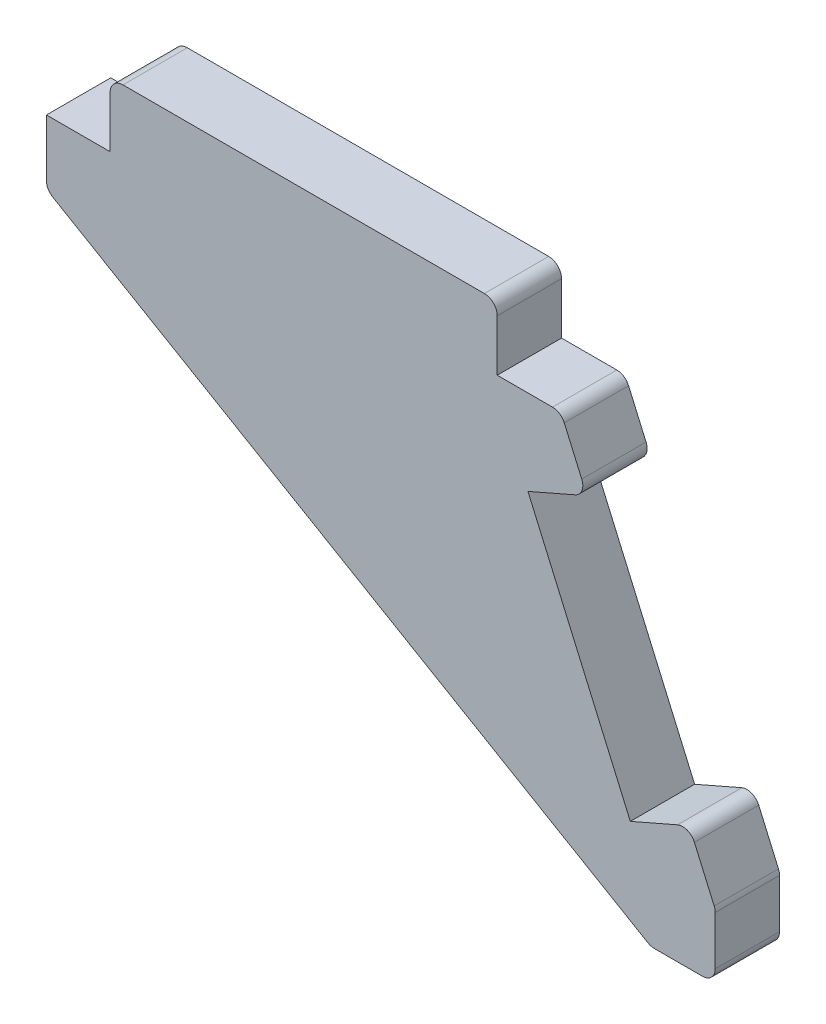
ISO-10303-21;
HEADER;
FILE_DESCRIPTION(('STEP AP214'),'2;1');
FILE_NAME('part.step','',(''),(''),'','','');
FILE_SCHEMA(('AUTOMOTIVE_DESIGN { 1 0 10303 214 1 1 1 1 }'));
ENDSEC;
DATA;
#1=APPLICATION_CONTEXT('core data for automotive mechanical design processes');
#2=APPLICATION_PROTOCOL_DEFINITION('international standard','automotive_design',2000,#1);
#3=PRODUCT_CONTEXT('',#1,'mechanical');
#4=PRODUCT('Part','Part','',(#3));
#5=PRODUCT_RELATED_PRODUCT_CATEGORY('part','',(#4));
#6=PRODUCT_DEFINITION_FORMATION('','',#4);
#7=PRODUCT_DEFINITION_CONTEXT('part definition',#1,'design');
#8=PRODUCT_DEFINITION('design','',#6,#7);
#9=PRODUCT_DEFINITION_SHAPE('','',#8);
#10=(LENGTH_UNIT() NAMED_UNIT(*) SI_UNIT(.MILLI.,.METRE.));
#11=(NAMED_UNIT(*) PLANE_ANGLE_UNIT() SI_UNIT($,.RADIAN.));
#12=(NAMED_UNIT(*) SI_UNIT($,.STERADIAN.) SOLID_ANGLE_UNIT());
#13=UNCERTAINTY_MEASURE_WITH_UNIT(LENGTH_MEASURE(1.E-05),#10,'distance_accuracy_value','');
#14=(GEOMETRIC_REPRESENTATION_CONTEXT(3) GLOBAL_UNCERTAINTY_ASSIGNED_CONTEXT((#13)) GLOBAL_UNIT_ASSIGNED_CONTEXT((#10,
#11,#12)) REPRESENTATION_CONTEXT('',''));
#15=CARTESIAN_POINT('',(0.,0.,0.));
#16=DIRECTION('',(0.,0.,1.));
#17=DIRECTION('',(1.,0.,0.));
#18=AXIS2_PLACEMENT_3D('',#15,#16,#17);
#19=CARTESIAN_POINT('',(4.95,5.00000000000043,5.));
#20=DIRECTION('',(1.,0.,0.));
#21=DIRECTION('',(0.,1.,0.));
#22=AXIS2_PLACEMENT_3D('',#19,#20,#21);
#23=PLANE('',#22);
#24=DIRECTION('',(0.,-1.,0.));
#25=VECTOR('',#24,1.);
#26=CARTESIAN_POINT('',(4.95,5.00000000000043,5.));
#27=LINE('',#26,#25);
#28=CARTESIAN_POINT('',(4.95,4.00000000000043,5.));
#29=VERTEX_POINT('',#28);
#30=CARTESIAN_POINT('',(4.95,0.,5.));
#31=VERTEX_POINT('',#30);
#32=EDGE_CURVE('E192',#29,#31,#27,.T.);
#33=ORIENTED_EDGE('',*,*,#32,.F.);
#34=DIRECTION('',(0.,0.,-1.));
#35=VECTOR('',#34,1.);
#36=CARTESIAN_POINT('',(4.95,4.00000000000043,5.));
#37=LINE('',#36,#35);
#38=CARTESIAN_POINT('',(4.95,4.00000000000043,0.));
#39=VERTEX_POINT('',#38);
#40=EDGE_CURVE('E11',#29,#39,#37,.T.);
#41=ORIENTED_EDGE('',*,*,#40,.T.);
#42=DIRECTION('',(0.,-1.,0.));
#43=VECTOR('',#42,1.);
#44=CARTESIAN_POINT('',(4.95,5.00000000000043,0.));
#45=LINE('',#44,#43);
#46=CARTESIAN_POINT('',(4.95,0.,0.));
#47=VERTEX_POINT('',#46);
#48=EDGE_CURVE('E216',#39,#47,#45,.T.);
#49=ORIENTED_EDGE('',*,*,#48,.T.);
#50=DIRECTION('',(0.,0.,-1.));
#51=VECTOR('',#50,1.);
#52=CARTESIAN_POINT('',(4.95,0.,5.));
#53=LINE('',#52,#51);
#54=EDGE_CURVE('E209',#31,#47,#53,.T.);
#55=ORIENTED_EDGE('',*,*,#54,.F.);
#56=EDGE_LOOP('',(#33,#41,#49,#55));
#57=FACE_BOUND('',#56,.T.);
#58=ADVANCED_FACE('F37',(#57),#23,.F.);
#59=CARTESIAN_POINT('',(4.95,0.,5.));
#60=DIRECTION('',(0.,-1.,0.));
#61=DIRECTION('',(1.,0.,0.));
#62=AXIS2_PLACEMENT_3D('',#59,#60,#61);
#63=PLANE('',#62);
#64=DIRECTION('',(-1.,0.,0.));
#65=VECTOR('',#64,1.);
#66=CARTESIAN_POINT('',(4.95,0.,0.));
#67=LINE('',#66,#65);
#68=CARTESIAN_POINT('',(0.,0.,0.));
#69=VERTEX_POINT('',#68);
#70=EDGE_CURVE('E370',#47,#69,#67,.T.);
#71=ORIENTED_EDGE('',*,*,#70,.T.);
#72=DIRECTION('',(0.,0.,-1.));
#73=VECTOR('',#72,1.);
#74=CARTESIAN_POINT('',(0.,0.,5.));
#75=LINE('',#74,#73);
#76=CARTESIAN_POINT('',(0.,0.,5.));
#77=VERTEX_POINT('',#76);
#78=EDGE_CURVE('E211',#77,#69,#75,.T.);
#79=ORIENTED_EDGE('',*,*,#78,.F.);
#80=DIRECTION('',(-1.,0.,0.));
#81=VECTOR('',#80,1.);
#82=CARTESIAN_POINT('',(4.95,0.,5.));
#83=LINE('',#82,#81);
#84=EDGE_CURVE('E197',#31,#77,#83,.T.);
#85=ORIENTED_EDGE('',*,*,#84,.F.);
#86=ORIENTED_EDGE('',*,*,#54,.T.);
#87=EDGE_LOOP('',(#71,#79,#85,#86));
#88=FACE_BOUND('',#87,.T.);
#89=ADVANCED_FACE('F208',(#88),#63,.F.);
#90=CARTESIAN_POINT('',(0.,0.,5.));
#91=DIRECTION('',(1.,0.,0.));
#92=DIRECTION('',(0.,1.,0.));
#93=AXIS2_PLACEMENT_3D('',#90,#91,#92);
#94=PLANE('',#93);
#95=DIRECTION('',(0.,-1.,0.));
#96=VECTOR('',#95,1.);
#97=CARTESIAN_POINT('',(0.,0.,0.));
#98=LINE('',#97,#96);
#99=CARTESIAN_POINT('',(0.,-4.42646043849972,0.));
#100=VERTEX_POINT('',#99);
#101=EDGE_CURVE('E372',#69,#100,#98,.T.);
#102=ORIENTED_EDGE('',*,*,#101,.T.);
#103=DIRECTION('',(0.,0.,-1.));
#104=VECTOR('',#103,1.);
#105=CARTESIAN_POINT('',(0.,-4.42646043849972,5.));
#106=LINE('',#105,#104);
#107=CARTESIAN_POINT('',(0.,-4.42646043849972,5.));
#108=VERTEX_POINT('',#107);
#109=EDGE_CURVE('E270',#100,#108,#106,.F.);
#110=ORIENTED_EDGE('',*,*,#109,.T.);
#111=DIRECTION('',(0.,-1.,0.));
#112=VECTOR('',#111,1.);
#113=CARTESIAN_POINT('',(0.,0.,5.));
#114=LINE('',#113,#112);
#115=EDGE_CURVE('E213',#77,#108,#114,.T.);
#116=ORIENTED_EDGE('',*,*,#115,.F.);
#117=ORIENTED_EDGE('',*,*,#78,.T.);
#118=EDGE_LOOP('',(#102,#110,#116,#117));
#119=FACE_BOUND('',#118,.T.);
#120=ADVANCED_FACE('F424',(#119),#94,.F.);
#121=CARTESIAN_POINT('',(0.,-5.,5.));
#122=DIRECTION('',(0.50495020040632,0.863148478020796,0.));
#123=DIRECTION('',(-0.863148478020796,0.50495020040632,0.));
#124=AXIS2_PLACEMENT_3D('',#121,#122,#123);
#125=PLANE('',#124);
#126=DIRECTION('',(0.863148478020796,-0.50495020040632,0.));
#127=VECTOR('',#126,1.);
#128=CARTESIAN_POINT('',(0.,-5.,5.));
#129=LINE('',#128,#127);
#130=CARTESIAN_POINT('',(0.49504979959368,-5.28960891652052,5.));
#131=VERTEX_POINT('',#130);
#132=CARTESIAN_POINT('',(46.7660696385189,-32.3586026477557,5.));
#133=VERTEX_POINT('',#132);
#134=EDGE_CURVE('E460',#131,#133,#129,.T.);
#135=ORIENTED_EDGE('',*,*,#134,.F.);
#136=DIRECTION('',(0.,0.,-1.));
#137=VECTOR('',#136,1.);
#138=CARTESIAN_POINT('',(0.49504979959368,-5.28960891652052,5.));
#139=LINE('',#138,#137);
#140=CARTESIAN_POINT('',(0.49504979959368,-5.28960891652052,0.));
#141=VERTEX_POINT('',#140);
#142=EDGE_CURVE('E267',#131,#141,#139,.T.);
#143=ORIENTED_EDGE('',*,*,#142,.T.);
#144=DIRECTION('',(0.863148478020796,-0.50495020040632,0.));
#145=VECTOR('',#144,1.);
#146=CARTESIAN_POINT('',(0.,-5.,0.));
#147=LINE('',#146,#145);
#148=CARTESIAN_POINT('',(46.7660696385189,-32.3586026477557,0.));
#149=VERTEX_POINT('',#148);
#150=EDGE_CURVE('E375',#141,#149,#147,.T.);
#151=ORIENTED_EDGE('',*,*,#150,.T.);
#152=DIRECTION('',(0.,0.,-1.));
#153=VECTOR('',#152,1.);
#154=CARTESIAN_POINT('',(46.7660696385189,-32.3586026477557,5.));
#155=LINE('',#154,#153);
#156=EDGE_CURVE('E265',#149,#133,#155,.F.);
#157=ORIENTED_EDGE('',*,*,#156,.T.);
#158=EDGE_LOOP('',(#135,#143,#151,#157));
#159=FACE_BOUND('',#158,.T.);
#160=ADVANCED_FACE('F487',(#159),#125,.F.);
#161=CARTESIAN_POINT('',(47.0000000000003,-32.4954541697349,5.));
#162=DIRECTION('',(0.,1.,0.));
#163=DIRECTION('',(0.,0.,1.));
#164=AXIS2_PLACEMENT_3D('',#161,#162,#163);
#165=PLANE('',#164);
#166=DIRECTION('',(1.,0.,0.));
#167=VECTOR('',#166,1.);
#168=CARTESIAN_POINT('',(47.0000000000003,-32.4954541697349,0.));
#169=LINE('',#168,#167);
#170=CARTESIAN_POINT('',(47.2710198389252,-32.4954541697349,0.));
#171=VERTEX_POINT('',#170);
#172=CARTESIAN_POINT('',(51.0000000000003,-32.4954541697349,0.));
#173=VERTEX_POINT('',#172);
#174=EDGE_CURVE('E378',#171,#173,#169,.T.);
#175=ORIENTED_EDGE('',*,*,#174,.T.);
#176=DIRECTION('',(0.,0.,-1.));
#177=VECTOR('',#176,1.);
#178=CARTESIAN_POINT('',(51.0000000000003,-32.4954541697349,5.));
#179=LINE('',#178,#177);
#180=CARTESIAN_POINT('',(51.0000000000003,-32.4954541697349,5.));
#181=VERTEX_POINT('',#180);
#182=EDGE_CURVE('E285',#173,#181,#179,.F.);
#183=ORIENTED_EDGE('',*,*,#182,.T.);
#184=DIRECTION('',(1.,0.,0.));
#185=VECTOR('',#184,1.);
#186=CARTESIAN_POINT('',(47.0000000000003,-32.4954541697349,5.));
#187=LINE('',#186,#185);
#188=CARTESIAN_POINT('',(47.2710198389252,-32.4954541697349,5.));
#189=VERTEX_POINT('',#188);
#190=EDGE_CURVE('E463',#189,#181,#187,.T.);
#191=ORIENTED_EDGE('',*,*,#190,.F.);
#192=DIRECTION('',(0.,0.,-1.));
#193=VECTOR('',#192,1.);
#194=CARTESIAN_POINT('',(47.2710198389252,-32.4954541697349,5.));
#195=LINE('',#194,#193);
#196=EDGE_CURVE('E282',#189,#171,#195,.T.);
#197=ORIENTED_EDGE('',*,*,#196,.T.);
#198=EDGE_LOOP('',(#175,#183,#191,#197));
#199=FACE_BOUND('',#198,.T.);
#200=ADVANCED_FACE('F479',(#199),#165,.F.);
#201=CARTESIAN_POINT('',(52.0000000000003,-27.4954541697349,5.));
#202=DIRECTION('',(-1.,0.,0.));
#203=DIRECTION('',(0.,0.,1.));
#204=AXIS2_PLACEMENT_3D('',#201,#202,#203);
#205=PLANE('',#204);
#206=DIRECTION('',(0.,1.,0.));
#207=VECTOR('',#206,1.);
#208=CARTESIAN_POINT('',(52.0000000000003,-27.4954541697349,0.));
#209=LINE('',#208,#207);
#210=CARTESIAN_POINT('',(52.0000000000003,-31.4954541697349,0.));
#211=VERTEX_POINT('',#210);
#212=CARTESIAN_POINT('',(52.0000000000003,-27.704166322257,0.));
#213=VERTEX_POINT('',#212);
#214=EDGE_CURVE('E381',#211,#213,#209,.T.);
#215=ORIENTED_EDGE('',*,*,#214,.T.);
#216=DIRECTION('',(0.,0.,-1.));
#217=VECTOR('',#216,1.);
#218=CARTESIAN_POINT('',(52.0000000000003,-27.704166322257,5.));
#219=LINE('',#218,#217);
#220=CARTESIAN_POINT('',(52.0000000000003,-27.704166322257,5.));
#221=VERTEX_POINT('',#220);
#222=EDGE_CURVE('E280',#213,#221,#219,.F.);
#223=ORIENTED_EDGE('',*,*,#222,.T.);
#224=DIRECTION('',(0.,1.,0.));
#225=VECTOR('',#224,1.);
#226=CARTESIAN_POINT('',(52.0000000000003,-27.4954541697349,5.));
#227=LINE('',#226,#225);
#228=CARTESIAN_POINT('',(52.0000000000003,-31.4954541697349,5.));
#229=VERTEX_POINT('',#228);
#230=EDGE_CURVE('E400',#229,#221,#227,.T.);
#231=ORIENTED_EDGE('',*,*,#230,.F.);
#232=DIRECTION('',(0.,0.,-1.));
#233=VECTOR('',#232,1.);
#234=CARTESIAN_POINT('',(52.0000000000003,-31.4954541697349,5.));
#235=LINE('',#234,#233);
#236=EDGE_CURVE('E277',#229,#211,#235,.T.);
#237=ORIENTED_EDGE('',*,*,#236,.T.);
#238=EDGE_LOOP('',(#215,#223,#231,#237));
#239=FACE_BOUND('',#238,.T.);
#240=ADVANCED_FACE('F475',(#239),#205,.F.);
#241=CARTESIAN_POINT('',(49.9800000000003,-22.8670527178295,5.));
#242=DIRECTION('',(-0.916515138991163,-0.400000000000013,0.));
#243=DIRECTION('',(0.400000000000013,-0.916515138991163,0.));
#244=AXIS2_PLACEMENT_3D('',#241,#242,#243);
#245=PLANE('',#244);
#246=DIRECTION('',(-0.400000000000013,0.916515138991163,0.));
#247=VECTOR('',#246,1.);
#248=CARTESIAN_POINT('',(49.9800000000003,-22.8670527178295,5.));
#249=LINE('',#248,#247);
#250=CARTESIAN_POINT('',(51.9165151389915,-27.304166322257,5.));
#251=VERTEX_POINT('',#250);
#252=CARTESIAN_POINT('',(50.3800000000003,-23.7835678568207,5.));
#253=VERTEX_POINT('',#252);
#254=EDGE_CURVE('E396',#251,#253,#249,.T.);
#255=ORIENTED_EDGE('',*,*,#254,.F.);
#256=DIRECTION('',(0.,0.,-1.));
#257=VECTOR('',#256,1.);
#258=CARTESIAN_POINT('',(51.9165151389915,-27.304166322257,5.));
#259=LINE('',#258,#257);
#260=CARTESIAN_POINT('',(51.9165151389915,-27.304166322257,0.));
#261=VERTEX_POINT('',#260);
#262=EDGE_CURVE('E274',#251,#261,#259,.T.);
#263=ORIENTED_EDGE('',*,*,#262,.T.);
#264=DIRECTION('',(-0.400000000000013,0.916515138991163,0.));
#265=VECTOR('',#264,1.);
#266=CARTESIAN_POINT('',(49.9800000000003,-22.8670527178295,0.));
#267=LINE('',#266,#265);
#268=CARTESIAN_POINT('',(50.3800000000003,-23.7835678568207,0.));
#269=VERTEX_POINT('',#268);
#270=EDGE_CURVE('E345',#261,#269,#267,.T.);
#271=ORIENTED_EDGE('',*,*,#270,.T.);
#272=DIRECTION('',(0.,0.,-1.));
#273=VECTOR('',#272,1.);
#274=CARTESIAN_POINT('',(50.3800000000003,-23.7835678568207,5.));
#275=LINE('',#274,#273);
#276=EDGE_CURVE('E272',#269,#253,#275,.F.);
#277=ORIENTED_EDGE('',*,*,#276,.T.);
#278=EDGE_LOOP('',(#255,#263,#271,#277));
#279=FACE_BOUND('',#278,.T.);
#280=ADVANCED_FACE('F388',(#279),#245,.F.);
#281=CARTESIAN_POINT('',(45.3974243050445,-24.8670527178296,5.));
#282=DIRECTION('',(0.400000000000013,-0.916515138991162,0.));
#283=DIRECTION('',(0.916515138991162,0.400000000000013,0.));
#284=AXIS2_PLACEMENT_3D('',#281,#282,#283);
#285=PLANE('',#284);
#286=DIRECTION('',(-0.916515138991162,-0.400000000000013,0.));
#287=VECTOR('',#286,1.);
#288=CARTESIAN_POINT('',(45.3974243050445,-24.8670527178296,5.));
#289=LINE('',#288,#287);
#290=CARTESIAN_POINT('',(49.0634848610091,-23.2670527178295,5.));
#291=VERTEX_POINT('',#290);
#292=CARTESIAN_POINT('',(45.3974243050445,-24.8670527178296,5.));
#293=VERTEX_POINT('',#292);
#294=EDGE_CURVE('E395',#291,#293,#289,.T.);
#295=ORIENTED_EDGE('',*,*,#294,.F.);
#296=DIRECTION('',(0.,0.,-1.));
#297=VECTOR('',#296,1.);
#298=CARTESIAN_POINT('',(49.0634848610091,-23.2670527178295,5.));
#299=LINE('',#298,#297);
#300=CARTESIAN_POINT('',(49.0634848610091,-23.2670527178295,0.));
#301=VERTEX_POINT('',#300);
#302=EDGE_CURVE('E287',#291,#301,#299,.T.);
#303=ORIENTED_EDGE('',*,*,#302,.T.);
#304=DIRECTION('',(-0.916515138991162,-0.400000000000013,0.));
#305=VECTOR('',#304,1.);
#306=CARTESIAN_POINT('',(45.3974243050445,-24.8670527178296,0.));
#307=LINE('',#306,#305);
#308=CARTESIAN_POINT('',(45.3974243050445,-24.8670527178296,0.));
#309=VERTEX_POINT('',#308);
#310=EDGE_CURVE('E339',#301,#309,#307,.T.);
#311=ORIENTED_EDGE('',*,*,#310,.T.);
#312=DIRECTION('',(0.,0.,-1.));
#313=VECTOR('',#312,1.);
#314=CARTESIAN_POINT('',(45.3974243050445,-24.8670527178296,5.));
#315=LINE('',#314,#313);
#316=EDGE_CURVE('E223',#293,#309,#315,.T.);
#317=ORIENTED_EDGE('',*,*,#316,.F.);
#318=EDGE_LOOP('',(#295,#303,#311,#317));
#319=FACE_BOUND('',#318,.T.);
#320=ADVANCED_FACE('F397',(#319),#285,.F.);
#321=CARTESIAN_POINT('',(37.4374243050442,-6.62840145190544,5.));
#322=DIRECTION('',(-0.916515138991163,-0.400000000000012,0.));
#323=DIRECTION('',(0.400000000000012,-0.916515138991163,0.));
#324=AXIS2_PLACEMENT_3D('',#321,#322,#323);
#325=PLANE('',#324);
#326=DIRECTION('',(-0.400000000000012,0.916515138991163,0.));
#327=VECTOR('',#326,1.);
#328=CARTESIAN_POINT('',(37.4374243050442,-6.62840145190544,0.));
#329=LINE('',#328,#327);
#330=CARTESIAN_POINT('',(37.4374243050442,-6.62840145190544,0.));
#331=VERTEX_POINT('',#330);
#332=EDGE_CURVE('E333',#309,#331,#329,.T.);
#333=ORIENTED_EDGE('',*,*,#332,.T.);
#334=DIRECTION('',(0.,0.,-1.));
#335=VECTOR('',#334,1.);
#336=CARTESIAN_POINT('',(37.4374243050442,-6.62840145190544,5.));
#337=LINE('',#336,#335);
#338=CARTESIAN_POINT('',(37.4374243050442,-6.62840145190544,5.));
#339=VERTEX_POINT('',#338);
#340=EDGE_CURVE('E324',#339,#331,#337,.T.);
#341=ORIENTED_EDGE('',*,*,#340,.F.);
#342=DIRECTION('',(-0.400000000000012,0.916515138991163,0.));
#343=VECTOR('',#342,1.);
#344=CARTESIAN_POINT('',(37.4374243050442,-6.62840145190544,5.));
#345=LINE('',#344,#343);
#346=EDGE_CURVE('E334',#293,#339,#345,.T.);
#347=ORIENTED_EDGE('',*,*,#346,.F.);
#348=ORIENTED_EDGE('',*,*,#316,.T.);
#349=EDGE_LOOP('',(#333,#341,#347,#348));
#350=FACE_BOUND('',#349,.T.);
#351=ADVANCED_FACE('F331',(#350),#325,.F.);
#352=CARTESIAN_POINT('',(42.0200000000001,-4.62840145190537,5.));
#353=DIRECTION('',(-0.400000000000013,0.916515138991163,0.));
#354=DIRECTION('',(-0.916515138991163,-0.400000000000013,0.));
#355=AXIS2_PLACEMENT_3D('',#352,#353,#354);
#356=PLANE('',#355);
#357=DIRECTION('',(0.916515138991162,0.400000000000013,0.));
#358=VECTOR('',#357,1.);
#359=CARTESIAN_POINT('',(42.0200000000001,-4.62840145190537,0.));
#360=LINE('',#359,#358);
#361=CARTESIAN_POINT('',(41.1034848610089,-5.02840145190539,0.));
#362=VERTEX_POINT('',#361);
#363=EDGE_CURVE('E341',#331,#362,#360,.T.);
#364=ORIENTED_EDGE('',*,*,#363,.T.);
#365=DIRECTION('',(0.,0.,-1.));
#366=VECTOR('',#365,1.);
#367=CARTESIAN_POINT('',(41.1034848610089,-5.02840145190539,5.));
#368=LINE('',#367,#366);
#369=CARTESIAN_POINT('',(41.1034848610089,-5.02840145190539,5.));
#370=VERTEX_POINT('',#369);
#371=EDGE_CURVE('E290',#362,#370,#368,.F.);
#372=ORIENTED_EDGE('',*,*,#371,.T.);
#373=DIRECTION('',(0.916515138991162,0.400000000000013,0.));
#374=VECTOR('',#373,1.);
#375=CARTESIAN_POINT('',(42.0200000000001,-4.62840145190537,5.));
#376=LINE('',#375,#374);
#377=EDGE_CURVE('E364',#339,#370,#376,.T.);
#378=ORIENTED_EDGE('',*,*,#377,.F.);
#379=ORIENTED_EDGE('',*,*,#340,.T.);
#380=EDGE_LOOP('',(#364,#372,#378,#379));
#381=FACE_BOUND('',#380,.T.);
#382=ADVANCED_FACE('F410',(#381),#356,.F.);
#383=CARTESIAN_POINT('',(42.0200000000001,-4.62840145190537,5.));
#384=DIRECTION('',(-0.916515138991163,-0.400000000000012,0.));
#385=DIRECTION('',(0.400000000000012,-0.916515138991163,0.));
#386=AXIS2_PLACEMENT_3D('',#383,#384,#385);
#387=PLANE('',#386);
#388=DIRECTION('',(-0.400000000000012,0.916515138991163,0.));
#389=VECTOR('',#388,1.);
#390=CARTESIAN_POINT('',(42.0200000000001,-4.62840145190537,0.));
#391=LINE('',#390,#389);
#392=CARTESIAN_POINT('',(41.62,-3.71188631291421,0.));
#393=VERTEX_POINT('',#392);
#394=CARTESIAN_POINT('',(40.2618614682832,-0.599999999999985,0.));
#395=VERTEX_POINT('',#394);
#396=EDGE_CURVE('E343',#393,#395,#391,.T.);
#397=ORIENTED_EDGE('',*,*,#396,.T.);
#398=DIRECTION('',(0.,0.,-1.));
#399=VECTOR('',#398,1.);
#400=CARTESIAN_POINT('',(40.2618614682832,-0.599999999999985,5.));
#401=LINE('',#400,#399);
#402=CARTESIAN_POINT('',(40.2618614682832,-0.599999999999985,5.));
#403=VERTEX_POINT('',#402);
#404=EDGE_CURVE('E247',#395,#403,#401,.F.);
#405=ORIENTED_EDGE('',*,*,#404,.T.);
#406=DIRECTION('',(-0.400000000000012,0.916515138991163,0.));
#407=VECTOR('',#406,1.);
#408=CARTESIAN_POINT('',(42.0200000000001,-4.62840145190537,5.));
#409=LINE('',#408,#407);
#410=CARTESIAN_POINT('',(41.62,-3.71188631291421,5.));
#411=VERTEX_POINT('',#410);
#412=EDGE_CURVE('E362',#411,#403,#409,.T.);
#413=ORIENTED_EDGE('',*,*,#412,.F.);
#414=DIRECTION('',(0.,0.,-1.));
#415=VECTOR('',#414,1.);
#416=CARTESIAN_POINT('',(41.62,-3.71188631291421,5.));
#417=LINE('',#416,#415);
#418=EDGE_CURVE('E244',#411,#393,#417,.T.);
#419=ORIENTED_EDGE('',*,*,#418,.T.);
#420=EDGE_LOOP('',(#397,#405,#413,#419));
#421=FACE_BOUND('',#420,.T.);
#422=ADVANCED_FACE('F357',(#421),#387,.F.);
#423=CARTESIAN_POINT('',(40.,0.,5.));
#424=DIRECTION('',(0.,-1.,0.));
#425=DIRECTION('',(1.,0.,0.));
#426=AXIS2_PLACEMENT_3D('',#423,#424,#425);
#427=PLANE('',#426);
#428=DIRECTION('',(-1.,0.,0.));
#429=VECTOR('',#428,1.);
#430=CARTESIAN_POINT('',(40.,0.,5.));
#431=LINE('',#430,#429);
#432=CARTESIAN_POINT('',(39.345346329292,0.,5.));
#433=VERTEX_POINT('',#432);
#434=CARTESIAN_POINT('',(35.05,0.,5.));
#435=VERTEX_POINT('',#434);
#436=EDGE_CURVE('E306',#433,#435,#431,.T.);
#437=ORIENTED_EDGE('',*,*,#436,.F.);
#438=DIRECTION('',(0.,0.,-1.));
#439=VECTOR('',#438,1.);
#440=CARTESIAN_POINT('',(39.345346329292,0.,5.));
#441=LINE('',#440,#439);
#442=CARTESIAN_POINT('',(39.345346329292,0.,0.));
#443=VERTEX_POINT('',#442);
#444=EDGE_CURVE('E218',#433,#443,#441,.T.);
#445=ORIENTED_EDGE('',*,*,#444,.T.);
#446=DIRECTION('',(-1.,0.,0.));
#447=VECTOR('',#446,1.);
#448=CARTESIAN_POINT('',(40.,0.,0.));
#449=LINE('',#448,#447);
#450=CARTESIAN_POINT('',(35.05,0.,0.));
#451=VERTEX_POINT('',#450);
#452=EDGE_CURVE('E318',#443,#451,#449,.T.);
#453=ORIENTED_EDGE('',*,*,#452,.T.);
#454=DIRECTION('',(0.,0.,-1.));
#455=VECTOR('',#454,1.);
#456=CARTESIAN_POINT('',(35.05,0.,5.));
#457=LINE('',#456,#455);
#458=EDGE_CURVE('E322',#435,#451,#457,.T.);
#459=ORIENTED_EDGE('',*,*,#458,.F.);
#460=EDGE_LOOP('',(#437,#445,#453,#459));
#461=FACE_BOUND('',#460,.T.);
#462=ADVANCED_FACE('F351',(#461),#427,.F.);
#463=CARTESIAN_POINT('',(35.05,5.00000000000043,5.));
#464=DIRECTION('',(-1.,0.,0.));
#465=DIRECTION('',(0.,0.,1.));
#466=AXIS2_PLACEMENT_3D('',#463,#464,#465);
#467=PLANE('',#466);
#468=DIRECTION('',(0.,1.,0.));
#469=VECTOR('',#468,1.);
#470=CARTESIAN_POINT('',(35.05,5.00000000000043,0.));
#471=LINE('',#470,#469);
#472=CARTESIAN_POINT('',(35.05,4.00000000000043,0.));
#473=VERTEX_POINT('',#472);
#474=EDGE_CURVE('E303',#451,#473,#471,.T.);
#475=ORIENTED_EDGE('',*,*,#474,.T.);
#476=DIRECTION('',(0.,0.,-1.));
#477=VECTOR('',#476,1.);
#478=CARTESIAN_POINT('',(35.05,4.00000000000043,5.));
#479=LINE('',#478,#477);
#480=CARTESIAN_POINT('',(35.05,4.00000000000043,5.));
#481=VERTEX_POINT('',#480);
#482=EDGE_CURVE('E45',#473,#481,#479,.F.);
#483=ORIENTED_EDGE('',*,*,#482,.T.);
#484=DIRECTION('',(0.,1.,0.));
#485=VECTOR('',#484,1.);
#486=CARTESIAN_POINT('',(35.05,5.00000000000043,5.));
#487=LINE('',#486,#485);
#488=EDGE_CURVE('E301',#435,#481,#487,.T.);
#489=ORIENTED_EDGE('',*,*,#488,.F.);
#490=ORIENTED_EDGE('',*,*,#458,.T.);
#491=EDGE_LOOP('',(#475,#483,#489,#490));
#492=FACE_BOUND('',#491,.T.);
#493=ADVANCED_FACE('F299',(#492),#467,.F.);
#494=CARTESIAN_POINT('',(35.05,5.00000000000043,5.));
#495=DIRECTION('',(0.,-1.,0.));
#496=DIRECTION('',(1.,0.,0.));
#497=AXIS2_PLACEMENT_3D('',#494,#495,#496);
#498=PLANE('',#497);
#499=DIRECTION('',(-1.,0.,0.));
#500=VECTOR('',#499,1.);
#501=CARTESIAN_POINT('',(35.05,5.00000000000043,5.));
#502=LINE('',#501,#500);
#503=CARTESIAN_POINT('',(34.05,5.00000000000043,5.));
#504=VERTEX_POINT('',#503);
#505=CARTESIAN_POINT('',(5.95,5.00000000000043,5.));
#506=VERTEX_POINT('',#505);
#507=EDGE_CURVE('E308',#504,#506,#502,.T.);
#508=ORIENTED_EDGE('',*,*,#507,.F.);
#509=DIRECTION('',(0.,0.,-1.));
#510=VECTOR('',#509,1.);
#511=CARTESIAN_POINT('',(34.05,5.00000000000043,5.));
#512=LINE('',#511,#510);
#513=CARTESIAN_POINT('',(34.05,5.00000000000043,0.));
#514=VERTEX_POINT('',#513);
#515=EDGE_CURVE('E293',#504,#514,#512,.T.);
#516=ORIENTED_EDGE('',*,*,#515,.T.);
#517=DIRECTION('',(-1.,0.,0.));
#518=VECTOR('',#517,1.);
#519=CARTESIAN_POINT('',(35.05,5.00000000000043,0.));
#520=LINE('',#519,#518);
#521=CARTESIAN_POINT('',(5.95,5.00000000000043,0.));
#522=VERTEX_POINT('',#521);
#523=EDGE_CURVE('E204',#514,#522,#520,.T.);
#524=ORIENTED_EDGE('',*,*,#523,.T.);
#525=DIRECTION('',(0.,0.,-1.));
#526=VECTOR('',#525,1.);
#527=CARTESIAN_POINT('',(5.95,5.00000000000043,5.));
#528=LINE('',#527,#526);
#529=EDGE_CURVE('E52',#522,#506,#528,.F.);
#530=ORIENTED_EDGE('',*,*,#529,.T.);
#531=EDGE_LOOP('',(#508,#516,#524,#530));
#532=FACE_BOUND('',#531,.T.);
#533=ADVANCED_FACE('F313',(#532),#498,.F.);
#534=CARTESIAN_POINT('',(0.,0.,5.));
#535=DIRECTION('',(0.,0.,-1.));
#536=DIRECTION('',(-1.,0.,0.));
#537=AXIS2_PLACEMENT_3D('',#534,#535,#536);
#538=PLANE('',#537);
#539=ORIENTED_EDGE('',*,*,#412,.T.);
#540=CARTESIAN_POINT('',(39.345346329292,-1.,5.));
#541=DIRECTION('',(0.,0.,-1.));
#542=DIRECTION('',(-1.,0.,0.));
#543=AXIS2_PLACEMENT_3D('',#540,#541,#542);
#544=CIRCLE('',#543,1.);
#545=EDGE_CURVE('E263',#403,#433,#544,.F.);
#546=ORIENTED_EDGE('',*,*,#545,.T.);
#547=ORIENTED_EDGE('',*,*,#436,.T.);
#548=ORIENTED_EDGE('',*,*,#488,.T.);
#549=CARTESIAN_POINT('',(34.05,4.00000000000043,5.));
#550=DIRECTION('',(0.,0.,-1.));
#551=DIRECTION('',(-1.,0.,0.));
#552=AXIS2_PLACEMENT_3D('',#549,#550,#551);
#553=CIRCLE('',#552,1.);
#554=EDGE_CURVE('E59',#481,#504,#553,.F.);
#555=ORIENTED_EDGE('',*,*,#554,.T.);
#556=ORIENTED_EDGE('',*,*,#507,.T.);
#557=CARTESIAN_POINT('',(5.95,4.00000000000043,5.));
#558=DIRECTION('',(0.,0.,-1.));
#559=DIRECTION('',(-1.,0.,0.));
#560=AXIS2_PLACEMENT_3D('',#557,#558,#559);
#561=CIRCLE('',#560,1.);
#562=EDGE_CURVE('E200',#506,#29,#561,.F.);
#563=ORIENTED_EDGE('',*,*,#562,.T.);
#564=ORIENTED_EDGE('',*,*,#32,.T.);
#565=ORIENTED_EDGE('',*,*,#84,.T.);
#566=ORIENTED_EDGE('',*,*,#115,.T.);
#567=CARTESIAN_POINT('',(1.,-4.42646043849972,5.));
#568=DIRECTION('',(0.,0.,-1.));
#569=DIRECTION('',(-1.,0.,0.));
#570=AXIS2_PLACEMENT_3D('',#567,#568,#569);
#571=CIRCLE('',#570,1.);
#572=EDGE_CURVE('E261',#108,#131,#571,.F.);
#573=ORIENTED_EDGE('',*,*,#572,.T.);
#574=ORIENTED_EDGE('',*,*,#134,.T.);
#575=CARTESIAN_POINT('',(47.2710198389252,-31.4954541697349,5.));
#576=DIRECTION('',(0.,0.,-1.));
#577=DIRECTION('',(-1.,0.,0.));
#578=AXIS2_PLACEMENT_3D('',#575,#576,#577);
#579=CIRCLE('',#578,1.);
#580=EDGE_CURVE('E255',#133,#189,#579,.F.);
#581=ORIENTED_EDGE('',*,*,#580,.T.);
#582=ORIENTED_EDGE('',*,*,#190,.T.);
#583=CARTESIAN_POINT('',(51.0000000000003,-31.4954541697349,5.));
#584=DIRECTION('',(0.,0.,-1.));
#585=DIRECTION('',(-1.,0.,0.));
#586=AXIS2_PLACEMENT_3D('',#583,#584,#585);
#587=CIRCLE('',#586,1.);
#588=EDGE_CURVE('E257',#181,#229,#587,.F.);
#589=ORIENTED_EDGE('',*,*,#588,.T.);
#590=ORIENTED_EDGE('',*,*,#230,.T.);
#591=CARTESIAN_POINT('',(51.0000000000003,-27.704166322257,5.));
#592=DIRECTION('',(0.,0.,-1.));
#593=DIRECTION('',(-1.,0.,0.));
#594=AXIS2_PLACEMENT_3D('',#591,#592,#593);
#595=CIRCLE('',#594,1.);
#596=EDGE_CURVE('E259',#221,#251,#595,.F.);
#597=ORIENTED_EDGE('',*,*,#596,.T.);
#598=ORIENTED_EDGE('',*,*,#254,.T.);
#599=CARTESIAN_POINT('',(49.4634848610091,-24.1835678568207,5.));
#600=DIRECTION('',(0.,0.,-1.));
#601=DIRECTION('',(-1.,0.,0.));
#602=AXIS2_PLACEMENT_3D('',#599,#600,#601);
#603=CIRCLE('',#602,1.);
#604=EDGE_CURVE('E253',#253,#291,#603,.F.);
#605=ORIENTED_EDGE('',*,*,#604,.T.);
#606=ORIENTED_EDGE('',*,*,#294,.T.);
#607=ORIENTED_EDGE('',*,*,#346,.T.);
#608=ORIENTED_EDGE('',*,*,#377,.T.);
#609=CARTESIAN_POINT('',(40.7034848610089,-4.11188631291422,5.));
#610=DIRECTION('',(0.,0.,-1.));
#611=DIRECTION('',(-1.,0.,0.));
#612=AXIS2_PLACEMENT_3D('',#609,#610,#611);
#613=CIRCLE('',#612,1.);
#614=EDGE_CURVE('E251',#370,#411,#613,.F.);
#615=ORIENTED_EDGE('',*,*,#614,.T.);
#616=EDGE_LOOP('',(#539,#546,#547,#548,#555,#556,#563,#564,#565,#566,#573,#574,#581,#582,#589,
#590,#597,#598,#605,#606,#607,#608,#615));
#617=FACE_BOUND('',#616,.T.);
#618=ADVANCED_FACE('F195',(#617),#538,.F.);
#619=CARTESIAN_POINT('',(0.,0.,0.));
#620=DIRECTION('',(0.,0.,-1.));
#621=DIRECTION('',(-1.,0.,0.));
#622=AXIS2_PLACEMENT_3D('',#619,#620,#621);
#623=PLANE('',#622);
#624=ORIENTED_EDGE('',*,*,#452,.F.);
#625=CARTESIAN_POINT('',(39.345346329292,-1.,0.));
#626=DIRECTION('',(0.,0.,-1.));
#627=DIRECTION('',(-1.,0.,0.));
#628=AXIS2_PLACEMENT_3D('',#625,#626,#627);
#629=CIRCLE('',#628,1.);
#630=EDGE_CURVE('E242',#443,#395,#629,.T.);
#631=ORIENTED_EDGE('',*,*,#630,.T.);
#632=ORIENTED_EDGE('',*,*,#396,.F.);
#633=CARTESIAN_POINT('',(40.7034848610089,-4.11188631291422,0.));
#634=DIRECTION('',(0.,0.,-1.));
#635=DIRECTION('',(-1.,0.,0.));
#636=AXIS2_PLACEMENT_3D('',#633,#634,#635);
#637=CIRCLE('',#636,1.);
#638=EDGE_CURVE('E230',#393,#362,#637,.T.);
#639=ORIENTED_EDGE('',*,*,#638,.T.);
#640=ORIENTED_EDGE('',*,*,#363,.F.);
#641=ORIENTED_EDGE('',*,*,#332,.F.);
#642=ORIENTED_EDGE('',*,*,#310,.F.);
#643=CARTESIAN_POINT('',(49.4634848610091,-24.1835678568207,0.));
#644=DIRECTION('',(0.,0.,-1.));
#645=DIRECTION('',(-1.,0.,0.));
#646=AXIS2_PLACEMENT_3D('',#643,#644,#645);
#647=CIRCLE('',#646,1.);
#648=EDGE_CURVE('E232',#301,#269,#647,.T.);
#649=ORIENTED_EDGE('',*,*,#648,.T.);
#650=ORIENTED_EDGE('',*,*,#270,.F.);
#651=CARTESIAN_POINT('',(51.0000000000003,-27.704166322257,0.));
#652=DIRECTION('',(0.,0.,-1.));
#653=DIRECTION('',(-1.,0.,0.));
#654=AXIS2_PLACEMENT_3D('',#651,#652,#653);
#655=CIRCLE('',#654,1.);
#656=EDGE_CURVE('E238',#261,#213,#655,.T.);
#657=ORIENTED_EDGE('',*,*,#656,.T.);
#658=ORIENTED_EDGE('',*,*,#214,.F.);
#659=CARTESIAN_POINT('',(51.0000000000003,-31.4954541697349,0.));
#660=DIRECTION('',(0.,0.,-1.));
#661=DIRECTION('',(-1.,0.,0.));
#662=AXIS2_PLACEMENT_3D('',#659,#660,#661);
#663=CIRCLE('',#662,1.);
#664=EDGE_CURVE('E236',#211,#173,#663,.T.);
#665=ORIENTED_EDGE('',*,*,#664,.T.);
#666=ORIENTED_EDGE('',*,*,#174,.F.);
#667=CARTESIAN_POINT('',(47.2710198389252,-31.4954541697349,0.));
#668=DIRECTION('',(0.,0.,-1.));
#669=DIRECTION('',(-1.,0.,0.));
#670=AXIS2_PLACEMENT_3D('',#667,#668,#669);
#671=CIRCLE('',#670,1.);
#672=EDGE_CURVE('E234',#171,#149,#671,.T.);
#673=ORIENTED_EDGE('',*,*,#672,.T.);
#674=ORIENTED_EDGE('',*,*,#150,.F.);
#675=CARTESIAN_POINT('',(1.,-4.42646043849972,0.));
#676=DIRECTION('',(0.,0.,-1.));
#677=DIRECTION('',(-1.,0.,0.));
#678=AXIS2_PLACEMENT_3D('',#675,#676,#677);
#679=CIRCLE('',#678,1.);
#680=EDGE_CURVE('E240',#141,#100,#679,.T.);
#681=ORIENTED_EDGE('',*,*,#680,.T.);
#682=ORIENTED_EDGE('',*,*,#101,.F.);
#683=ORIENTED_EDGE('',*,*,#70,.F.);
#684=ORIENTED_EDGE('',*,*,#48,.F.);
#685=CARTESIAN_POINT('',(5.95,4.00000000000043,0.));
#686=DIRECTION('',(0.,0.,-1.));
#687=DIRECTION('',(-1.,0.,0.));
#688=AXIS2_PLACEMENT_3D('',#685,#686,#687);
#689=CIRCLE('',#688,1.);
#690=EDGE_CURVE('E221',#39,#522,#689,.T.);
#691=ORIENTED_EDGE('',*,*,#690,.T.);
#692=ORIENTED_EDGE('',*,*,#523,.F.);
#693=CARTESIAN_POINT('',(34.05,4.00000000000043,0.));
#694=DIRECTION('',(0.,0.,-1.));
#695=DIRECTION('',(-1.,0.,0.));
#696=AXIS2_PLACEMENT_3D('',#693,#694,#695);
#697=CIRCLE('',#696,1.);
#698=EDGE_CURVE('E228',#514,#473,#697,.T.);
#699=ORIENTED_EDGE('',*,*,#698,.T.);
#700=ORIENTED_EDGE('',*,*,#474,.F.);
#701=EDGE_LOOP('',(#624,#631,#632,#639,#640,#641,#642,#649,#650,#657,#658,#665,#666,#673,#674,
#681,#682,#683,#684,#691,#692,#699,#700));
#702=FACE_BOUND('',#701,.T.);
#703=ADVANCED_FACE('F316',(#702),#623,.T.);
#704=CARTESIAN_POINT('',(39.345346329292,-1.,5.));
#705=DIRECTION('',(0.,0.,-1.));
#706=DIRECTION('',(-1.,0.,0.));
#707=AXIS2_PLACEMENT_3D('',#704,#705,#706);
#708=CYLINDRICAL_SURFACE('',#707,1.);
#709=ORIENTED_EDGE('',*,*,#545,.F.);
#710=ORIENTED_EDGE('',*,*,#404,.F.);
#711=ORIENTED_EDGE('',*,*,#630,.F.);
#712=ORIENTED_EDGE('',*,*,#444,.F.);
#713=EDGE_LOOP('',(#709,#710,#711,#712));
#714=FACE_BOUND('',#713,.T.);
#715=ADVANCED_FACE('F361',(#714),#708,.T.);
#716=CARTESIAN_POINT('',(1.,-4.42646043849972,5.));
#717=DIRECTION('',(0.,0.,-1.));
#718=DIRECTION('',(-1.,0.,0.));
#719=AXIS2_PLACEMENT_3D('',#716,#717,#718);
#720=CYLINDRICAL_SURFACE('',#719,1.);
#721=ORIENTED_EDGE('',*,*,#572,.F.);
#722=ORIENTED_EDGE('',*,*,#109,.F.);
#723=ORIENTED_EDGE('',*,*,#680,.F.);
#724=ORIENTED_EDGE('',*,*,#142,.F.);
#725=EDGE_LOOP('',(#721,#722,#723,#724));
#726=FACE_BOUND('',#725,.T.);
#727=ADVANCED_FACE('F430',(#726),#720,.T.);
#728=CARTESIAN_POINT('',(51.0000000000003,-27.704166322257,5.));
#729=DIRECTION('',(0.,0.,-1.));
#730=DIRECTION('',(-1.,0.,0.));
#731=AXIS2_PLACEMENT_3D('',#728,#729,#730);
#732=CYLINDRICAL_SURFACE('',#731,1.);
#733=ORIENTED_EDGE('',*,*,#596,.F.);
#734=ORIENTED_EDGE('',*,*,#222,.F.);
#735=ORIENTED_EDGE('',*,*,#656,.F.);
#736=ORIENTED_EDGE('',*,*,#262,.F.);
#737=EDGE_LOOP('',(#733,#734,#735,#736));
#738=FACE_BOUND('',#737,.T.);
#739=ADVANCED_FACE('F433',(#738),#732,.T.);
#740=CARTESIAN_POINT('',(51.0000000000003,-31.4954541697349,5.));
#741=DIRECTION('',(0.,0.,-1.));
#742=DIRECTION('',(-1.,0.,0.));
#743=AXIS2_PLACEMENT_3D('',#740,#741,#742);
#744=CYLINDRICAL_SURFACE('',#743,1.);
#745=ORIENTED_EDGE('',*,*,#588,.F.);
#746=ORIENTED_EDGE('',*,*,#182,.F.);
#747=ORIENTED_EDGE('',*,*,#664,.F.);
#748=ORIENTED_EDGE('',*,*,#236,.F.);
#749=EDGE_LOOP('',(#745,#746,#747,#748));
#750=FACE_BOUND('',#749,.T.);
#751=ADVANCED_FACE('F437',(#750),#744,.T.);
#752=CARTESIAN_POINT('',(47.2710198389252,-31.4954541697349,5.));
#753=DIRECTION('',(0.,0.,-1.));
#754=DIRECTION('',(-1.,0.,0.));
#755=AXIS2_PLACEMENT_3D('',#752,#753,#754);
#756=CYLINDRICAL_SURFACE('',#755,1.);
#757=ORIENTED_EDGE('',*,*,#580,.F.);
#758=ORIENTED_EDGE('',*,*,#156,.F.);
#759=ORIENTED_EDGE('',*,*,#672,.F.);
#760=ORIENTED_EDGE('',*,*,#196,.F.);
#761=EDGE_LOOP('',(#757,#758,#759,#760));
#762=FACE_BOUND('',#761,.T.);
#763=ADVANCED_FACE('F441',(#762),#756,.T.);
#764=CARTESIAN_POINT('',(49.4634848610091,-24.1835678568207,5.));
#765=DIRECTION('',(0.,0.,-1.));
#766=DIRECTION('',(-1.,0.,0.));
#767=AXIS2_PLACEMENT_3D('',#764,#765,#766);
#768=CYLINDRICAL_SURFACE('',#767,1.);
#769=ORIENTED_EDGE('',*,*,#604,.F.);
#770=ORIENTED_EDGE('',*,*,#276,.F.);
#771=ORIENTED_EDGE('',*,*,#648,.F.);
#772=ORIENTED_EDGE('',*,*,#302,.F.);
#773=EDGE_LOOP('',(#769,#770,#771,#772));
#774=FACE_BOUND('',#773,.T.);
#775=ADVANCED_FACE('F393',(#774),#768,.T.);
#776=CARTESIAN_POINT('',(40.7034848610089,-4.11188631291422,5.));
#777=DIRECTION('',(0.,0.,-1.));
#778=DIRECTION('',(-1.,0.,0.));
#779=AXIS2_PLACEMENT_3D('',#776,#777,#778);
#780=CYLINDRICAL_SURFACE('',#779,1.);
#781=ORIENTED_EDGE('',*,*,#614,.F.);
#782=ORIENTED_EDGE('',*,*,#371,.F.);
#783=ORIENTED_EDGE('',*,*,#638,.F.);
#784=ORIENTED_EDGE('',*,*,#418,.F.);
#785=EDGE_LOOP('',(#781,#782,#783,#784));
#786=FACE_BOUND('',#785,.T.);
#787=ADVANCED_FACE('F409',(#786),#780,.T.);
#788=CARTESIAN_POINT('',(34.05,4.00000000000043,5.));
#789=DIRECTION('',(0.,0.,-1.));
#790=DIRECTION('',(-1.,0.,0.));
#791=AXIS2_PLACEMENT_3D('',#788,#789,#790);
#792=CYLINDRICAL_SURFACE('',#791,1.);
#793=ORIENTED_EDGE('',*,*,#554,.F.);
#794=ORIENTED_EDGE('',*,*,#482,.F.);
#795=ORIENTED_EDGE('',*,*,#698,.F.);
#796=ORIENTED_EDGE('',*,*,#515,.F.);
#797=EDGE_LOOP('',(#793,#794,#795,#796));
#798=FACE_BOUND('',#797,.T.);
#799=ADVANCED_FACE('F311',(#798),#792,.T.);
#800=CARTESIAN_POINT('',(5.95,4.00000000000043,5.));
#801=DIRECTION('',(0.,0.,-1.));
#802=DIRECTION('',(-1.,0.,0.));
#803=AXIS2_PLACEMENT_3D('',#800,#801,#802);
#804=CYLINDRICAL_SURFACE('',#803,1.);
#805=ORIENTED_EDGE('',*,*,#562,.F.);
#806=ORIENTED_EDGE('',*,*,#529,.F.);
#807=ORIENTED_EDGE('',*,*,#690,.F.);
#808=ORIENTED_EDGE('',*,*,#40,.F.);
#809=EDGE_LOOP('',(#805,#806,#807,#808));
#810=FACE_BOUND('',#809,.T.);
#811=ADVANCED_FACE('F39',(#810),#804,.T.);
#812=CLOSED_SHELL('',(#58,#89,#120,#160,#200,#240,#280,#320,#351,#382,#422,#462,#493,#533,#618,
#703,#715,#727,#739,#751,#763,#775,#787,#799,#811));
#813=MANIFOLD_SOLID_BREP('B2',#812);
#814=ADVANCED_BREP_SHAPE_REPRESENTATION('',(#18,#813),#14);
#815=SHAPE_DEFINITION_REPRESENTATION(#9,#814);
ENDSEC;
END-ISO-10303-21;
